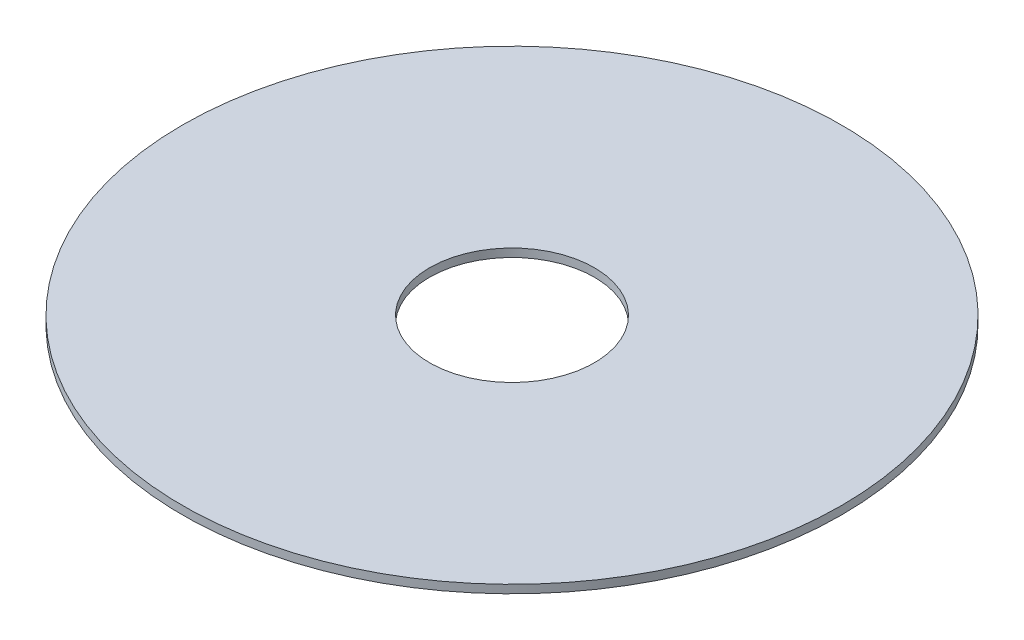
ISO-10303-21;
HEADER;
FILE_DESCRIPTION(('STEP AP214'),'2;1');
FILE_NAME('part.step','',(''),(''),'','','');
FILE_SCHEMA(('AUTOMOTIVE_DESIGN { 1 0 10303 214 1 1 1 1 }'));
ENDSEC;
DATA;
#1=APPLICATION_CONTEXT('core data for automotive mechanical design processes');
#2=APPLICATION_PROTOCOL_DEFINITION('international standard','automotive_design',2000,#1);
#3=PRODUCT_CONTEXT('',#1,'mechanical');
#4=PRODUCT('Part','Part','',(#3));
#5=PRODUCT_RELATED_PRODUCT_CATEGORY('part','',(#4));
#6=PRODUCT_DEFINITION_FORMATION('','',#4);
#7=PRODUCT_DEFINITION_CONTEXT('part definition',#1,'design');
#8=PRODUCT_DEFINITION('design','',#6,#7);
#9=PRODUCT_DEFINITION_SHAPE('','',#8);
#10=(LENGTH_UNIT() NAMED_UNIT(*) SI_UNIT(.MILLI.,.METRE.));
#11=(NAMED_UNIT(*) PLANE_ANGLE_UNIT() SI_UNIT($,.RADIAN.));
#12=(NAMED_UNIT(*) SI_UNIT($,.STERADIAN.) SOLID_ANGLE_UNIT());
#13=UNCERTAINTY_MEASURE_WITH_UNIT(LENGTH_MEASURE(1.E-05),#10,'distance_accuracy_value','');
#14=(GEOMETRIC_REPRESENTATION_CONTEXT(3) GLOBAL_UNCERTAINTY_ASSIGNED_CONTEXT((#13)) GLOBAL_UNIT_ASSIGNED_CONTEXT((#10,
#11,#12)) REPRESENTATION_CONTEXT('',''));
#15=CARTESIAN_POINT('',(0.,0.,0.));
#16=DIRECTION('',(0.,0.,1.));
#17=DIRECTION('',(1.,0.,0.));
#18=AXIS2_PLACEMENT_3D('',#15,#16,#17);
#19=CARTESIAN_POINT('',(0.,0.25,0.));
#20=DIRECTION('',(0.,1.,0.));
#21=DIRECTION('',(1.,0.,0.));
#22=AXIS2_PLACEMENT_3D('',#19,#20,#21);
#23=PLANE('',#22);
#24=CARTESIAN_POINT('',(0.,0.25,0.));
#25=DIRECTION('',(0.,1.,0.));
#26=DIRECTION('',(-1.,0.,0.));
#27=AXIS2_PLACEMENT_3D('',#24,#25,#26);
#28=CIRCLE('',#27,5.);
#29=CARTESIAN_POINT('',(-5.,0.25,0.));
#30=VERTEX_POINT('',#29);
#31=EDGE_CURVE('E9',#30,#30,#28,.T.);
#32=ORIENTED_EDGE('',*,*,#31,.F.);
#33=EDGE_LOOP('',(#32));
#34=FACE_BOUND('',#33,.T.);
#35=CARTESIAN_POINT('',(0.,0.25,0.));
#36=DIRECTION('',(0.,1.,0.));
#37=DIRECTION('',(-1.,0.,0.));
#38=AXIS2_PLACEMENT_3D('',#35,#36,#37);
#39=CIRCLE('',#38,20.);
#40=CARTESIAN_POINT('',(-20.,0.25,0.));
#41=VERTEX_POINT('',#40);
#42=EDGE_CURVE('E39',#41,#41,#39,.T.);
#43=ORIENTED_EDGE('',*,*,#42,.T.);
#44=EDGE_LOOP('',(#43));
#45=FACE_BOUND('',#44,.T.);
#46=ADVANCED_FACE('F14',(#34,#45),#23,.T.);
#47=CARTESIAN_POINT('',(0.,-0.25,0.));
#48=DIRECTION('',(0.,1.,0.));
#49=DIRECTION('',(1.,0.,0.));
#50=AXIS2_PLACEMENT_3D('',#47,#48,#49);
#51=PLANE('',#50);
#52=CARTESIAN_POINT('',(0.,-0.25,0.));
#53=DIRECTION('',(0.,1.,0.));
#54=DIRECTION('',(-1.,0.,0.));
#55=AXIS2_PLACEMENT_3D('',#52,#53,#54);
#56=CIRCLE('',#55,5.);
#57=CARTESIAN_POINT('',(-5.,-0.25,0.));
#58=VERTEX_POINT('',#57);
#59=EDGE_CURVE('E22',#58,#58,#56,.T.);
#60=ORIENTED_EDGE('',*,*,#59,.T.);
#61=EDGE_LOOP('',(#60));
#62=FACE_BOUND('',#61,.T.);
#63=CARTESIAN_POINT('',(0.,-0.25,0.));
#64=DIRECTION('',(0.,1.,0.));
#65=DIRECTION('',(-1.,0.,0.));
#66=AXIS2_PLACEMENT_3D('',#63,#64,#65);
#67=CIRCLE('',#66,20.);
#68=CARTESIAN_POINT('',(-20.,-0.25,0.));
#69=VERTEX_POINT('',#68);
#70=EDGE_CURVE('E31',#69,#69,#67,.T.);
#71=ORIENTED_EDGE('',*,*,#70,.F.);
#72=EDGE_LOOP('',(#71));
#73=FACE_BOUND('',#72,.T.);
#74=ADVANCED_FACE('F16',(#62,#73),#51,.F.);
#75=CARTESIAN_POINT('',(0.,0.,0.));
#76=DIRECTION('',(0.,1.,0.));
#77=DIRECTION('',(-1.,0.,0.));
#78=AXIS2_PLACEMENT_3D('',#75,#76,#77);
#79=CYLINDRICAL_SURFACE('',#78,5.);
#80=ORIENTED_EDGE('',*,*,#31,.T.);
#81=EDGE_LOOP('',(#80));
#82=FACE_BOUND('',#81,.T.);
#83=ORIENTED_EDGE('',*,*,#59,.F.);
#84=EDGE_LOOP('',(#83));
#85=FACE_BOUND('',#84,.T.);
#86=ADVANCED_FACE('F50',(#82,#85),#79,.F.);
#87=CARTESIAN_POINT('',(0.,0.,0.));
#88=DIRECTION('',(0.,1.,0.));
#89=DIRECTION('',(-1.,0.,0.));
#90=AXIS2_PLACEMENT_3D('',#87,#88,#89);
#91=CYLINDRICAL_SURFACE('',#90,20.);
#92=ORIENTED_EDGE('',*,*,#70,.T.);
#93=EDGE_LOOP('',(#92));
#94=FACE_BOUND('',#93,.T.);
#95=ORIENTED_EDGE('',*,*,#42,.F.);
#96=EDGE_LOOP('',(#95));
#97=FACE_BOUND('',#96,.T.);
#98=ADVANCED_FACE('F48',(#94,#97),#91,.T.);
#99=CLOSED_SHELL('',(#46,#74,#86,#98));
#100=MANIFOLD_SOLID_BREP('B1',#99);
#101=ADVANCED_BREP_SHAPE_REPRESENTATION('',(#18,#100),#14);
#102=SHAPE_DEFINITION_REPRESENTATION(#9,#101);
ENDSEC;
END-ISO-10303-21;
